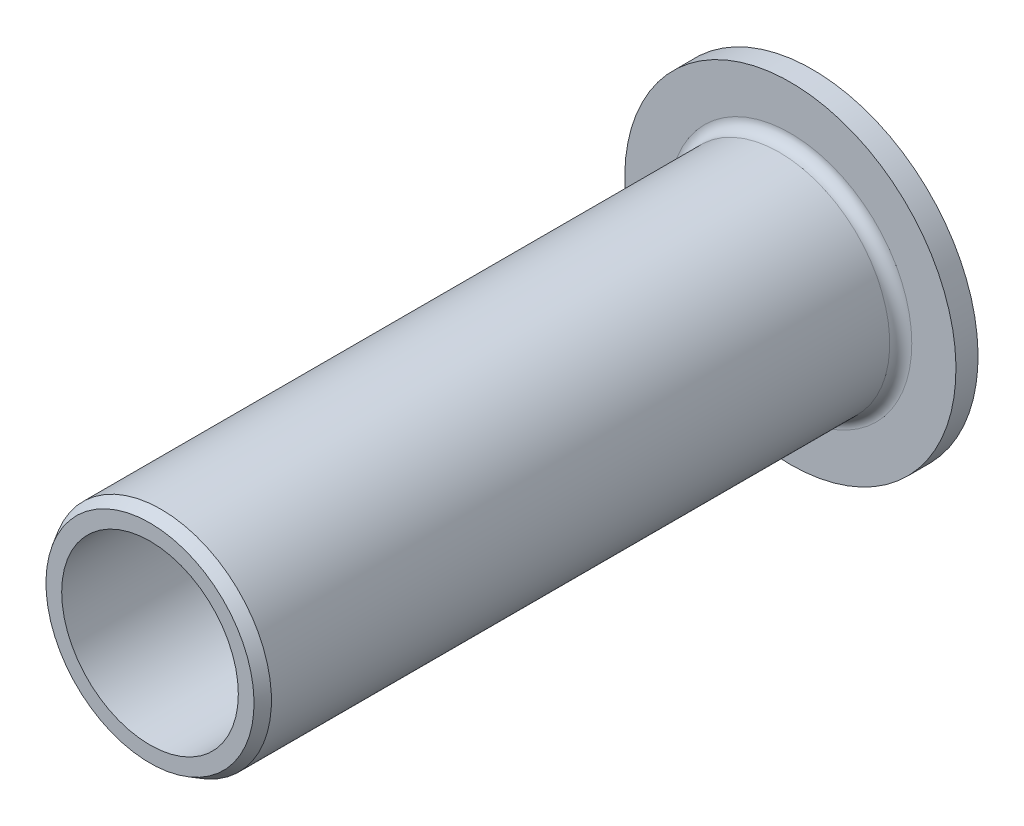
ISO-10303-21;
HEADER;
FILE_DESCRIPTION(('STEP AP214'),'2;1');
FILE_NAME('part.step','',(''),(''),'','','');
FILE_SCHEMA(('AUTOMOTIVE_DESIGN { 1 0 10303 214 1 1 1 1 }'));
ENDSEC;
DATA;
#1=APPLICATION_CONTEXT('core data for automotive mechanical design processes');
#2=APPLICATION_PROTOCOL_DEFINITION('international standard','automotive_design',2000,#1);
#3=PRODUCT_CONTEXT('',#1,'mechanical');
#4=PRODUCT('Part','Part','',(#3));
#5=PRODUCT_RELATED_PRODUCT_CATEGORY('part','',(#4));
#6=PRODUCT_DEFINITION_FORMATION('','',#4);
#7=PRODUCT_DEFINITION_CONTEXT('part definition',#1,'design');
#8=PRODUCT_DEFINITION('design','',#6,#7);
#9=PRODUCT_DEFINITION_SHAPE('','',#8);
#10=(LENGTH_UNIT() NAMED_UNIT(*) SI_UNIT(.MILLI.,.METRE.));
#11=(NAMED_UNIT(*) PLANE_ANGLE_UNIT() SI_UNIT($,.RADIAN.));
#12=(NAMED_UNIT(*) SI_UNIT($,.STERADIAN.) SOLID_ANGLE_UNIT());
#13=UNCERTAINTY_MEASURE_WITH_UNIT(LENGTH_MEASURE(1.E-05),#10,'distance_accuracy_value','');
#14=(GEOMETRIC_REPRESENTATION_CONTEXT(3) GLOBAL_UNCERTAINTY_ASSIGNED_CONTEXT((#13)) GLOBAL_UNIT_ASSIGNED_CONTEXT((#10,
#11,#12)) REPRESENTATION_CONTEXT('',''));
#15=CARTESIAN_POINT('',(0.,0.,0.));
#16=DIRECTION('',(0.,0.,1.));
#17=DIRECTION('',(1.,0.,0.));
#18=AXIS2_PLACEMENT_3D('',#15,#16,#17);
#19=CARTESIAN_POINT('',(5.75,0.,0.));
#20=DIRECTION('',(0.,0.,-1.));
#21=DIRECTION('',(0.,1.,0.));
#22=AXIS2_PLACEMENT_3D('',#19,#20,#21);
#23=PLANE('',#22);
#24=CARTESIAN_POINT('',(0.,0.,0.));
#25=DIRECTION('',(0.,0.,1.));
#26=DIRECTION('',(0.,-1.,0.));
#27=AXIS2_PLACEMENT_3D('',#24,#25,#26);
#28=CIRCLE('',#27,4.);
#29=CARTESIAN_POINT('',(0.,-4.,0.));
#30=VERTEX_POINT('',#29);
#31=EDGE_CURVE('E42',#30,#30,#28,.F.);
#32=ORIENTED_EDGE('',*,*,#31,.F.);
#33=EDGE_LOOP('',(#32));
#34=FACE_BOUND('',#33,.T.);
#35=CARTESIAN_POINT('',(0.,0.,0.));
#36=DIRECTION('',(0.,0.,1.));
#37=DIRECTION('',(0.,-1.,0.));
#38=AXIS2_PLACEMENT_3D('',#35,#36,#37);
#39=CIRCLE('',#38,7.5);
#40=CARTESIAN_POINT('',(0.,-7.5,0.));
#41=VERTEX_POINT('',#40);
#42=EDGE_CURVE('E17',#41,#41,#39,.T.);
#43=ORIENTED_EDGE('',*,*,#42,.F.);
#44=EDGE_LOOP('',(#43));
#45=FACE_BOUND('',#44,.T.);
#46=ADVANCED_FACE('F14',(#34,#45),#23,.T.);
#47=CARTESIAN_POINT('',(0.,0.,0.5));
#48=DIRECTION('',(0.,0.,1.));
#49=DIRECTION('',(0.,-1.,0.));
#50=AXIS2_PLACEMENT_3D('',#47,#48,#49);
#51=CYLINDRICAL_SURFACE('',#50,7.5);
#52=CARTESIAN_POINT('',(0.,0.,1.));
#53=DIRECTION('',(0.,0.,1.));
#54=DIRECTION('',(0.,-1.,0.));
#55=AXIS2_PLACEMENT_3D('',#52,#53,#54);
#56=CIRCLE('',#55,7.5);
#57=CARTESIAN_POINT('',(0.,-7.5,1.));
#58=VERTEX_POINT('',#57);
#59=EDGE_CURVE('E40',#58,#58,#56,.T.);
#60=ORIENTED_EDGE('',*,*,#59,.F.);
#61=EDGE_LOOP('',(#60));
#62=FACE_BOUND('',#61,.T.);
#63=ORIENTED_EDGE('',*,*,#42,.T.);
#64=EDGE_LOOP('',(#63));
#65=FACE_BOUND('',#64,.T.);
#66=ADVANCED_FACE('F49',(#62,#65),#51,.T.);
#67=CARTESIAN_POINT('',(0.,0.,0.));
#68=DIRECTION('',(0.,0.,1.));
#69=DIRECTION('',(0.,-1.,0.));
#70=AXIS2_PLACEMENT_3D('',#67,#68,#69);
#71=CYLINDRICAL_SURFACE('',#70,4.);
#72=ORIENTED_EDGE('',*,*,#31,.T.);
#73=EDGE_LOOP('',(#72));
#74=FACE_BOUND('',#73,.T.);
#75=CARTESIAN_POINT('',(0.,0.,30.));
#76=DIRECTION('',(0.,0.,1.));
#77=DIRECTION('',(0.,-1.,0.));
#78=AXIS2_PLACEMENT_3D('',#75,#76,#77);
#79=CIRCLE('',#78,4.);
#80=CARTESIAN_POINT('',(0.,-4.,30.));
#81=VERTEX_POINT('',#80);
#82=EDGE_CURVE('E37',#81,#81,#79,.F.);
#83=ORIENTED_EDGE('',*,*,#82,.F.);
#84=EDGE_LOOP('',(#83));
#85=FACE_BOUND('',#84,.T.);
#86=ADVANCED_FACE('F57',(#74,#85),#71,.F.);
#87=CARTESIAN_POINT('',(6.5,0.,1.));
#88=DIRECTION('',(0.,0.,1.));
#89=DIRECTION('',(0.,-1.,0.));
#90=AXIS2_PLACEMENT_3D('',#87,#88,#89);
#91=PLANE('',#90);
#92=ORIENTED_EDGE('',*,*,#59,.T.);
#93=EDGE_LOOP('',(#92));
#94=FACE_BOUND('',#93,.T.);
#95=CARTESIAN_POINT('',(0.,0.,1.));
#96=DIRECTION('',(0.,0.,1.));
#97=DIRECTION('',(1.,0.,0.));
#98=AXIS2_PLACEMENT_3D('',#95,#96,#97);
#99=CIRCLE('',#98,5.5);
#100=CARTESIAN_POINT('',(5.5,0.,1.));
#101=VERTEX_POINT('',#100);
#102=EDGE_CURVE('E36',#101,#101,#99,.T.);
#103=ORIENTED_EDGE('',*,*,#102,.F.);
#104=EDGE_LOOP('',(#103));
#105=FACE_BOUND('',#104,.T.);
#106=ADVANCED_FACE('F85',(#94,#105),#91,.T.);
#107=CARTESIAN_POINT('',(4.35566243270259,0.,30.));
#108=DIRECTION('',(0.,0.,1.));
#109=DIRECTION('',(0.,-1.,0.));
#110=AXIS2_PLACEMENT_3D('',#107,#108,#109);
#111=PLANE('',#110);
#112=CARTESIAN_POINT('',(0.,0.,30.0000000000296));
#113=DIRECTION('',(0.,0.,-1.));
#114=DIRECTION('',(0.,1.,0.));
#115=AXIS2_PLACEMENT_3D('',#112,#113,#114);
#116=CIRCLE('',#115,4.71132486535453);
#117=CARTESIAN_POINT('',(0.,4.71132486535453,30.0000000000296));
#118=VERTEX_POINT('',#117);
#119=EDGE_CURVE('E26',#118,#118,#116,.T.);
#120=ORIENTED_EDGE('',*,*,#119,.F.);
#121=EDGE_LOOP('',(#120));
#122=FACE_BOUND('',#121,.T.);
#123=ORIENTED_EDGE('',*,*,#82,.T.);
#124=EDGE_LOOP('',(#123));
#125=FACE_BOUND('',#124,.T.);
#126=ADVANCED_FACE('F74',(#122,#125),#111,.T.);
#127=CARTESIAN_POINT('',(0.,0.,1.5));
#128=DIRECTION('',(0.,0.,1.));
#129=DIRECTION('',(0.,-1.,0.));
#130=AXIS2_PLACEMENT_3D('',#127,#128,#129);
#131=TOROIDAL_SURFACE('',#130,5.5,0.5);
#132=ORIENTED_EDGE('',*,*,#102,.T.);
#133=EDGE_LOOP('',(#132));
#134=FACE_BOUND('',#133,.T.);
#135=CARTESIAN_POINT('',(0.,0.,1.5));
#136=DIRECTION('',(0.,0.,1.));
#137=DIRECTION('',(0.,-1.,0.));
#138=AXIS2_PLACEMENT_3D('',#135,#136,#137);
#139=CIRCLE('',#138,5.);
#140=CARTESIAN_POINT('',(0.,-5.,1.5));
#141=VERTEX_POINT('',#140);
#142=EDGE_CURVE('E21',#141,#141,#139,.T.);
#143=ORIENTED_EDGE('',*,*,#142,.F.);
#144=EDGE_LOOP('',(#143));
#145=FACE_BOUND('',#144,.T.);
#146=ADVANCED_FACE('F67',(#134,#145),#131,.F.);
#147=CARTESIAN_POINT('',(0.,0.,29.4999999999277));
#148=DIRECTION('',(0.,0.,-1.));
#149=DIRECTION('',(0.,1.,0.));
#150=AXIS2_PLACEMENT_3D('',#147,#148,#149);
#151=CONICAL_SURFACE('',#150,4.99999999999545,0.523598775579252);
#152=ORIENTED_EDGE('',*,*,#119,.T.);
#153=EDGE_LOOP('',(#152));
#154=FACE_BOUND('',#153,.T.);
#155=CARTESIAN_POINT('',(0.,0.,29.5));
#156=DIRECTION('',(0.,0.,1.));
#157=DIRECTION('',(0.,-1.,0.));
#158=AXIS2_PLACEMENT_3D('',#155,#156,#157);
#159=CIRCLE('',#158,5.);
#160=CARTESIAN_POINT('',(0.,-5.,29.5));
#161=VERTEX_POINT('',#160);
#162=EDGE_CURVE('E10',#161,#161,#159,.F.);
#163=ORIENTED_EDGE('',*,*,#162,.F.);
#164=EDGE_LOOP('',(#163));
#165=FACE_BOUND('',#164,.T.);
#166=ADVANCED_FACE('F61',(#154,#165),#151,.T.);
#167=CARTESIAN_POINT('',(0.,0.,15.5));
#168=DIRECTION('',(0.,0.,1.));
#169=DIRECTION('',(0.,-1.,0.));
#170=AXIS2_PLACEMENT_3D('',#167,#168,#169);
#171=CYLINDRICAL_SURFACE('',#170,5.);
#172=ORIENTED_EDGE('',*,*,#142,.T.);
#173=EDGE_LOOP('',(#172));
#174=FACE_BOUND('',#173,.T.);
#175=ORIENTED_EDGE('',*,*,#162,.T.);
#176=EDGE_LOOP('',(#175));
#177=FACE_BOUND('',#176,.T.);
#178=ADVANCED_FACE('F59',(#174,#177),#171,.T.);
#179=CLOSED_SHELL('',(#46,#66,#86,#106,#126,#146,#166,#178));
#180=MANIFOLD_SOLID_BREP('B1',#179);
#181=ADVANCED_BREP_SHAPE_REPRESENTATION('',(#18,#180),#14);
#182=SHAPE_DEFINITION_REPRESENTATION(#9,#181);
ENDSEC;
END-ISO-10303-21;
